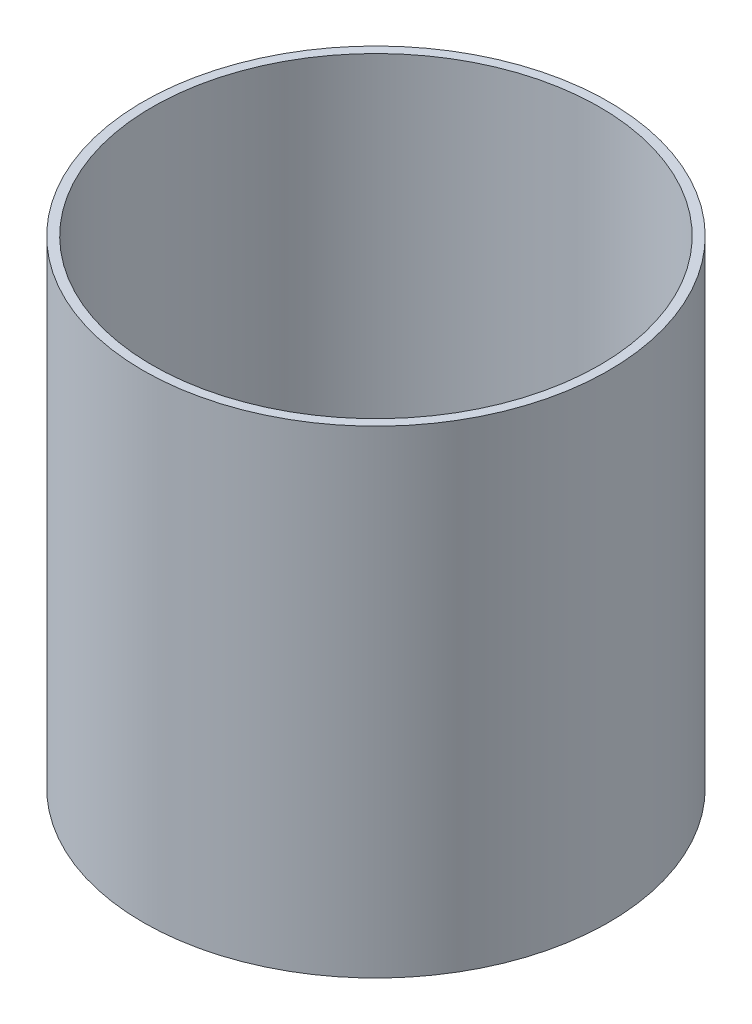
ISO-10303-21;
HEADER;
FILE_DESCRIPTION(('STEP AP214'),'2;1');
FILE_NAME('part.step','',(''),(''),'','','');
FILE_SCHEMA(('AUTOMOTIVE_DESIGN { 1 0 10303 214 1 1 1 1 }'));
ENDSEC;
DATA;
#1=APPLICATION_CONTEXT('core data for automotive mechanical design processes');
#2=APPLICATION_PROTOCOL_DEFINITION('international standard','automotive_design',2000,#1);
#3=PRODUCT_CONTEXT('',#1,'mechanical');
#4=PRODUCT('Part','Part','',(#3));
#5=PRODUCT_RELATED_PRODUCT_CATEGORY('part','',(#4));
#6=PRODUCT_DEFINITION_FORMATION('','',#4);
#7=PRODUCT_DEFINITION_CONTEXT('part definition',#1,'design');
#8=PRODUCT_DEFINITION('design','',#6,#7);
#9=PRODUCT_DEFINITION_SHAPE('','',#8);
#10=(LENGTH_UNIT() NAMED_UNIT(*) SI_UNIT(.MILLI.,.METRE.));
#11=(NAMED_UNIT(*) PLANE_ANGLE_UNIT() SI_UNIT($,.RADIAN.));
#12=(NAMED_UNIT(*) SI_UNIT($,.STERADIAN.) SOLID_ANGLE_UNIT());
#13=UNCERTAINTY_MEASURE_WITH_UNIT(LENGTH_MEASURE(1.E-05),#10,'distance_accuracy_value','');
#14=(GEOMETRIC_REPRESENTATION_CONTEXT(3) GLOBAL_UNCERTAINTY_ASSIGNED_CONTEXT((#13)) GLOBAL_UNIT_ASSIGNED_CONTEXT((#10,
#11,#12)) REPRESENTATION_CONTEXT('',''));
#15=CARTESIAN_POINT('',(0.,0.,0.));
#16=DIRECTION('',(0.,0.,1.));
#17=DIRECTION('',(1.,0.,0.));
#18=AXIS2_PLACEMENT_3D('',#15,#16,#17);
#19=CARTESIAN_POINT('',(0.,78.,0.));
#20=DIRECTION('',(0.,1.,0.));
#21=DIRECTION('',(0.,0.,1.));
#22=AXIS2_PLACEMENT_3D('',#19,#20,#21);
#23=PLANE('',#22);
#24=CARTESIAN_POINT('',(0.,78.,0.));
#25=DIRECTION('',(0.,1.,0.));
#26=DIRECTION('',(0.,0.,1.));
#27=AXIS2_PLACEMENT_3D('',#24,#25,#26);
#28=CIRCLE('',#27,38.);
#29=CARTESIAN_POINT('',(0.,78.,38.));
#30=VERTEX_POINT('',#29);
#31=EDGE_CURVE('E11',#30,#30,#28,.T.);
#32=ORIENTED_EDGE('',*,*,#31,.T.);
#33=EDGE_LOOP('',(#32));
#34=FACE_BOUND('',#33,.T.);
#35=CARTESIAN_POINT('',(0.,78.,0.));
#36=DIRECTION('',(0.,1.,0.));
#37=DIRECTION('',(1.,0.,0.));
#38=AXIS2_PLACEMENT_3D('',#35,#36,#37);
#39=CIRCLE('',#38,36.5);
#40=CARTESIAN_POINT('',(36.5,78.,0.));
#41=VERTEX_POINT('',#40);
#42=EDGE_CURVE('E49',#41,#41,#39,.T.);
#43=ORIENTED_EDGE('',*,*,#42,.F.);
#44=EDGE_LOOP('',(#43));
#45=FACE_BOUND('',#44,.T.);
#46=ADVANCED_FACE('F38',(#34,#45),#23,.T.);
#47=CARTESIAN_POINT('',(0.,0.,0.));
#48=DIRECTION('',(0.,1.,0.));
#49=DIRECTION('',(0.,0.,1.));
#50=AXIS2_PLACEMENT_3D('',#47,#48,#49);
#51=PLANE('',#50);
#52=CARTESIAN_POINT('',(0.,0.,0.));
#53=DIRECTION('',(0.,1.,0.));
#54=DIRECTION('',(0.,0.,1.));
#55=AXIS2_PLACEMENT_3D('',#52,#53,#54);
#56=CIRCLE('',#55,38.);
#57=CARTESIAN_POINT('',(0.,0.,38.));
#58=VERTEX_POINT('',#57);
#59=EDGE_CURVE('E42',#58,#58,#56,.T.);
#60=ORIENTED_EDGE('',*,*,#59,.F.);
#61=EDGE_LOOP('',(#60));
#62=FACE_BOUND('',#61,.T.);
#63=CARTESIAN_POINT('',(0.,0.,0.));
#64=DIRECTION('',(0.,1.,0.));
#65=DIRECTION('',(1.,0.,0.));
#66=AXIS2_PLACEMENT_3D('',#63,#64,#65);
#67=CIRCLE('',#66,36.5);
#68=CARTESIAN_POINT('',(36.5,0.,0.));
#69=VERTEX_POINT('',#68);
#70=EDGE_CURVE('E51',#69,#69,#67,.T.);
#71=ORIENTED_EDGE('',*,*,#70,.T.);
#72=EDGE_LOOP('',(#71));
#73=FACE_BOUND('',#72,.T.);
#74=ADVANCED_FACE('F61',(#62,#73),#51,.F.);
#75=CARTESIAN_POINT('',(0.,78.,0.));
#76=DIRECTION('',(0.,-1.,0.));
#77=DIRECTION('',(0.,0.,-1.));
#78=AXIS2_PLACEMENT_3D('',#75,#76,#77);
#79=CYLINDRICAL_SURFACE('',#78,38.);
#80=ORIENTED_EDGE('',*,*,#31,.F.);
#81=EDGE_LOOP('',(#80));
#82=FACE_BOUND('',#81,.T.);
#83=ORIENTED_EDGE('',*,*,#59,.T.);
#84=EDGE_LOOP('',(#83));
#85=FACE_BOUND('',#84,.T.);
#86=ADVANCED_FACE('F40',(#82,#85),#79,.T.);
#87=CARTESIAN_POINT('',(0.,78.,0.));
#88=DIRECTION('',(0.,-1.,0.));
#89=DIRECTION('',(0.,0.,-1.));
#90=AXIS2_PLACEMENT_3D('',#87,#88,#89);
#91=CYLINDRICAL_SURFACE('',#90,36.5);
#92=ORIENTED_EDGE('',*,*,#42,.T.);
#93=EDGE_LOOP('',(#92));
#94=FACE_BOUND('',#93,.T.);
#95=ORIENTED_EDGE('',*,*,#70,.F.);
#96=EDGE_LOOP('',(#95));
#97=FACE_BOUND('',#96,.T.);
#98=ADVANCED_FACE('F57',(#94,#97),#91,.F.);
#99=CLOSED_SHELL('',(#46,#74,#86,#98));
#100=MANIFOLD_SOLID_BREP('B2',#99);
#101=ADVANCED_BREP_SHAPE_REPRESENTATION('',(#18,#100),#14);
#102=SHAPE_DEFINITION_REPRESENTATION(#9,#101);
ENDSEC;
END-ISO-10303-21;
